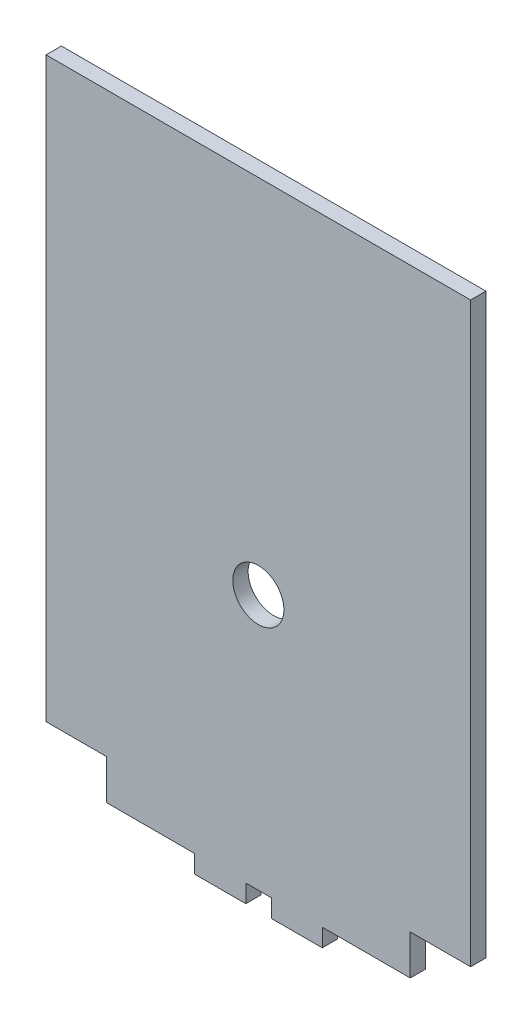
ISO-10303-21;
HEADER;
FILE_DESCRIPTION(('STEP AP214'),'2;1');
FILE_NAME('part.step','',(''),(''),'','','');
FILE_SCHEMA(('AUTOMOTIVE_DESIGN { 1 0 10303 214 1 1 1 1 }'));
ENDSEC;
DATA;
#1=APPLICATION_CONTEXT('core data for automotive mechanical design processes');
#2=APPLICATION_PROTOCOL_DEFINITION('international standard','automotive_design',2000,#1);
#3=PRODUCT_CONTEXT('',#1,'mechanical');
#4=PRODUCT('Part','Part','',(#3));
#5=PRODUCT_RELATED_PRODUCT_CATEGORY('part','',(#4));
#6=PRODUCT_DEFINITION_FORMATION('','',#4);
#7=PRODUCT_DEFINITION_CONTEXT('part definition',#1,'design');
#8=PRODUCT_DEFINITION('design','',#6,#7);
#9=PRODUCT_DEFINITION_SHAPE('','',#8);
#10=(LENGTH_UNIT() NAMED_UNIT(*) SI_UNIT(.MILLI.,.METRE.));
#11=(NAMED_UNIT(*) PLANE_ANGLE_UNIT() SI_UNIT($,.RADIAN.));
#12=(NAMED_UNIT(*) SI_UNIT($,.STERADIAN.) SOLID_ANGLE_UNIT());
#13=UNCERTAINTY_MEASURE_WITH_UNIT(LENGTH_MEASURE(1.E-05),#10,'distance_accuracy_value','');
#14=(GEOMETRIC_REPRESENTATION_CONTEXT(3) GLOBAL_UNCERTAINTY_ASSIGNED_CONTEXT((#13)) GLOBAL_UNIT_ASSIGNED_CONTEXT((#10,
#11,#12)) REPRESENTATION_CONTEXT('',''));
#15=CARTESIAN_POINT('',(0.,0.,0.));
#16=DIRECTION('',(0.,0.,1.));
#17=DIRECTION('',(1.,0.,0.));
#18=AXIS2_PLACEMENT_3D('',#15,#16,#17);
#19=CARTESIAN_POINT('',(0.,0.,3.));
#20=DIRECTION('',(0.,0.,-1.));
#21=DIRECTION('',(-1.,0.,0.));
#22=AXIS2_PLACEMENT_3D('',#19,#20,#21);
#23=PLANE('',#22);
#24=DIRECTION('',(-0.999999999999963,2.71602498102676E-07,0.));
#25=VECTOR('',#24,1.);
#26=CARTESIAN_POINT('',(38.6232862395123,-12.8450645036732,3.));
#27=LINE('',#26,#25);
#28=CARTESIAN_POINT('',(93.1522290063544,-12.8450793139341,3.));
#29=VERTEX_POINT('',#28);
#30=CARTESIAN_POINT('',(10.1522276542944,-12.8450567709591,3.));
#31=VERTEX_POINT('',#30);
#32=EDGE_CURVE('E50',#29,#31,#27,.T.);
#33=ORIENTED_EDGE('',*,*,#32,.T.);
#34=DIRECTION('',(-1.79961441962756E-07,-0.999999999999984,0.));
#35=VECTOR('',#34,1.);
#36=CARTESIAN_POINT('',(10.1522226708003,-40.5370668536615,3.));
#37=LINE('',#36,#35);
#38=CARTESIAN_POINT('',(10.1522226708003,-40.5370668536615,3.));
#39=VERTEX_POINT('',#38);
#40=EDGE_CURVE('E308',#31,#39,#37,.T.);
#41=ORIENTED_EDGE('',*,*,#40,.T.);
#42=DIRECTION('',(-2.15869174278283E-07,-0.999999999999977,0.));
#43=VECTOR('',#42,1.);
#44=CARTESIAN_POINT('',(10.1522226708003,-40.5370668536615,3.));
#45=LINE('',#44,#43);
#46=CARTESIAN_POINT('',(10.1522042770186,-125.745072081253,3.));
#47=VERTEX_POINT('',#46);
#48=EDGE_CURVE('E309',#39,#47,#45,.T.);
#49=ORIENTED_EDGE('',*,*,#48,.T.);
#50=DIRECTION('',(0.999999999999999,-3.74925588958727E-08,0.));
#51=VECTOR('',#50,1.);
#52=CARTESIAN_POINT('',(10.1522042770186,-125.745072081253,3.));
#53=LINE('',#52,#51);
#54=CARTESIAN_POINT('',(21.9522041501799,-125.745072523666,3.));
#55=VERTEX_POINT('',#54);
#56=EDGE_CURVE('E256',#47,#55,#53,.T.);
#57=ORIENTED_EDGE('',*,*,#56,.T.);
#58=DIRECTION('',(-2.87206058910175E-07,-0.999999999999959,0.));
#59=VECTOR('',#58,1.);
#60=CARTESIAN_POINT('',(21.9522041501799,-125.745072523666,3.));
#61=LINE('',#60,#59);
#62=CARTESIAN_POINT('',(21.9522019127166,-133.535518227548,3.));
#63=VERTEX_POINT('',#62);
#64=EDGE_CURVE('E276',#55,#63,#61,.T.);
#65=ORIENTED_EDGE('',*,*,#64,.T.);
#66=DIRECTION('',(0.99999988146846,-0.000486891226533724,0.));
#67=VECTOR('',#66,1.);
#68=CARTESIAN_POINT('',(21.9522019127166,-133.535518227548,3.));
#69=LINE('',#68,#67);
#70=CARTESIAN_POINT('',(39.1522154593375,-133.543892764233,3.));
#71=VERTEX_POINT('',#70);
#72=EDGE_CURVE('E273',#63,#71,#69,.T.);
#73=ORIENTED_EDGE('',*,*,#72,.T.);
#74=DIRECTION('',(0.,-1.,0.));
#75=VECTOR('',#74,1.);
#76=CARTESIAN_POINT('',(39.1522154593375,-133.543892764233,3.));
#77=LINE('',#76,#75);
#78=CARTESIAN_POINT('',(39.1522154593377,-137.037426112164,3.));
#79=VERTEX_POINT('',#78);
#80=EDGE_CURVE('E275',#71,#79,#77,.T.);
#81=ORIENTED_EDGE('',*,*,#80,.T.);
#82=DIRECTION('',(1.,0.,0.));
#83=VECTOR('',#82,1.);
#84=CARTESIAN_POINT('',(39.1522154593377,-137.037426112164,3.));
#85=LINE('',#84,#83);
#86=CARTESIAN_POINT('',(49.2022154593377,-137.037426112164,3.));
#87=VERTEX_POINT('',#86);
#88=EDGE_CURVE('E278',#79,#87,#85,.T.);
#89=ORIENTED_EDGE('',*,*,#88,.T.);
#90=DIRECTION('',(0.,1.,0.));
#91=VECTOR('',#90,1.);
#92=CARTESIAN_POINT('',(49.2022154593377,-137.037426112164,3.));
#93=LINE('',#92,#91);
#94=CARTESIAN_POINT('',(49.2022154593377,-133.537426112164,3.));
#95=VERTEX_POINT('',#94);
#96=EDGE_CURVE('E284',#87,#95,#93,.T.);
#97=ORIENTED_EDGE('',*,*,#96,.T.);
#98=DIRECTION('',(1.,0.,0.));
#99=VECTOR('',#98,1.);
#100=CARTESIAN_POINT('',(49.2022154593377,-133.537426112164,3.));
#101=LINE('',#100,#99);
#102=CARTESIAN_POINT('',(54.2022154593377,-133.537426112164,3.));
#103=VERTEX_POINT('',#102);
#104=EDGE_CURVE('E286',#95,#103,#101,.T.);
#105=ORIENTED_EDGE('',*,*,#104,.T.);
#106=DIRECTION('',(0.,-1.,0.));
#107=VECTOR('',#106,1.);
#108=CARTESIAN_POINT('',(54.2022154593377,-133.537426112164,3.));
#109=LINE('',#108,#107);
#110=CARTESIAN_POINT('',(54.2022154593377,-137.037426112164,3.));
#111=VERTEX_POINT('',#110);
#112=EDGE_CURVE('E288',#103,#111,#109,.T.);
#113=ORIENTED_EDGE('',*,*,#112,.T.);
#114=DIRECTION('',(1.,0.,0.));
#115=VECTOR('',#114,1.);
#116=CARTESIAN_POINT('',(54.2022154593377,-137.037426112164,3.));
#117=LINE('',#116,#115);
#118=CARTESIAN_POINT('',(64.1522154593377,-137.037426112164,3.));
#119=VERTEX_POINT('',#118);
#120=EDGE_CURVE('E290',#111,#119,#117,.T.);
#121=ORIENTED_EDGE('',*,*,#120,.T.);
#122=DIRECTION('',(0.,1.,0.));
#123=VECTOR('',#122,1.);
#124=CARTESIAN_POINT('',(64.1522154593377,-137.037426112164,3.));
#125=LINE('',#124,#123);
#126=CARTESIAN_POINT('',(64.1522154593377,-133.537426112164,3.));
#127=VERTEX_POINT('',#126);
#128=EDGE_CURVE('E292',#119,#127,#125,.T.);
#129=ORIENTED_EDGE('',*,*,#128,.T.);
#130=DIRECTION('',(0.999999965177503,-0.000263903376842765,0.));
#131=VECTOR('',#130,1.);
#132=CARTESIAN_POINT('',(64.1522154593377,-133.537426112164,3.));
#133=LINE('',#132,#131);
#134=CARTESIAN_POINT('',(81.3522290063543,-133.541965253979,3.));
#135=VERTEX_POINT('',#134);
#136=EDGE_CURVE('E165',#127,#135,#133,.T.);
#137=ORIENTED_EDGE('',*,*,#136,.T.);
#138=DIRECTION('',(0.,1.,0.));
#139=VECTOR('',#138,1.);
#140=CARTESIAN_POINT('',(81.3522290063543,-133.541965253979,3.));
#141=LINE('',#140,#139);
#142=CARTESIAN_POINT('',(81.3522290063544,-125.745072523665,3.));
#143=VERTEX_POINT('',#142);
#144=EDGE_CURVE('E159',#135,#143,#141,.T.);
#145=ORIENTED_EDGE('',*,*,#144,.T.);
#146=DIRECTION('',(1.,0.,0.));
#147=VECTOR('',#146,1.);
#148=CARTESIAN_POINT('',(81.3522290063544,-125.745072523665,3.));
#149=LINE('',#148,#147);
#150=CARTESIAN_POINT('',(93.1522290063544,-125.745072523665,3.));
#151=VERTEX_POINT('',#150);
#152=EDGE_CURVE('E163',#143,#151,#149,.T.);
#153=ORIENTED_EDGE('',*,*,#152,.T.);
#154=DIRECTION('',(0.,1.,0.));
#155=VECTOR('',#154,1.);
#156=CARTESIAN_POINT('',(93.1522290063544,-125.745072523665,3.));
#157=LINE('',#156,#155);
#158=EDGE_CURVE('E179',#151,#29,#157,.T.);
#159=ORIENTED_EDGE('',*,*,#158,.T.);
#160=EDGE_LOOP('',(#33,#41,#49,#57,#65,#73,#81,#89,#97,#105,#113,#121,#129,#137,#145,#153,#159));
#161=FACE_BOUND('',#160,.T.);
#162=CARTESIAN_POINT('',(51.6522290063544,-83.5450793139341,3.));
#163=DIRECTION('',(0.,0.,1.));
#164=DIRECTION('',(1.,0.,0.));
#165=AXIS2_PLACEMENT_3D('',#162,#163,#164);
#166=CIRCLE('',#165,5.);
#167=CARTESIAN_POINT('',(56.6522290063544,-83.5450793139341,3.));
#168=VERTEX_POINT('',#167);
#169=EDGE_CURVE('E188',#168,#168,#166,.T.);
#170=ORIENTED_EDGE('',*,*,#169,.F.);
#171=EDGE_LOOP('',(#170));
#172=FACE_BOUND('',#171,.T.);
#173=ADVANCED_FACE('F33',(#161,#172),#23,.F.);
#174=CARTESIAN_POINT('',(0.,0.,0.));
#175=DIRECTION('',(0.,0.,-1.));
#176=DIRECTION('',(-1.,0.,0.));
#177=AXIS2_PLACEMENT_3D('',#174,#175,#176);
#178=PLANE('',#177);
#179=DIRECTION('',(-1.79961441962756E-07,-0.999999999999984,0.));
#180=VECTOR('',#179,1.);
#181=CARTESIAN_POINT('',(10.1522226708003,-40.5370668536615,0.));
#182=LINE('',#181,#180);
#183=CARTESIAN_POINT('',(10.1522276542944,-12.8450567709591,0.));
#184=VERTEX_POINT('',#183);
#185=CARTESIAN_POINT('',(10.1522226708003,-40.5370668536615,0.));
#186=VERTEX_POINT('',#185);
#187=EDGE_CURVE('E185',#184,#186,#182,.T.);
#188=ORIENTED_EDGE('',*,*,#187,.F.);
#189=DIRECTION('',(-0.999999999999963,2.71588916447412E-07,0.));
#190=VECTOR('',#189,1.);
#191=CARTESIAN_POINT('',(51.4522289791975,-12.8450679880461,0.));
#192=LINE('',#191,#190);
#193=CARTESIAN_POINT('',(93.1522290063544,-12.8450793139341,0.));
#194=VERTEX_POINT('',#193);
#195=EDGE_CURVE('E114',#194,#184,#192,.T.);
#196=ORIENTED_EDGE('',*,*,#195,.F.);
#197=DIRECTION('',(0.,1.,0.));
#198=VECTOR('',#197,1.);
#199=CARTESIAN_POINT('',(93.1522290063544,-125.745072523665,0.));
#200=LINE('',#199,#198);
#201=CARTESIAN_POINT('',(93.1522290063544,-125.745072523665,0.));
#202=VERTEX_POINT('',#201);
#203=EDGE_CURVE('E214',#202,#194,#200,.T.);
#204=ORIENTED_EDGE('',*,*,#203,.F.);
#205=DIRECTION('',(1.,0.,0.));
#206=VECTOR('',#205,1.);
#207=CARTESIAN_POINT('',(81.3522290063544,-125.745072523665,0.));
#208=LINE('',#207,#206);
#209=CARTESIAN_POINT('',(81.3522290063544,-125.745072523665,0.));
#210=VERTEX_POINT('',#209);
#211=EDGE_CURVE('E107',#210,#202,#208,.T.);
#212=ORIENTED_EDGE('',*,*,#211,.F.);
#213=DIRECTION('',(0.,1.,0.));
#214=VECTOR('',#213,1.);
#215=CARTESIAN_POINT('',(81.3522290063543,-133.541965253979,0.));
#216=LINE('',#215,#214);
#217=CARTESIAN_POINT('',(81.3522290063543,-133.541965253979,0.));
#218=VERTEX_POINT('',#217);
#219=EDGE_CURVE('E173',#218,#210,#216,.T.);
#220=ORIENTED_EDGE('',*,*,#219,.F.);
#221=DIRECTION('',(0.999999965177503,-0.000263903376842765,0.));
#222=VECTOR('',#221,1.);
#223=CARTESIAN_POINT('',(64.1522154593377,-133.537426112164,0.));
#224=LINE('',#223,#222);
#225=CARTESIAN_POINT('',(64.1522154593377,-133.537426112164,0.));
#226=VERTEX_POINT('',#225);
#227=EDGE_CURVE('E210',#226,#218,#224,.T.);
#228=ORIENTED_EDGE('',*,*,#227,.F.);
#229=DIRECTION('',(0.,1.,0.));
#230=VECTOR('',#229,1.);
#231=CARTESIAN_POINT('',(64.1522154593377,-137.037426112164,0.));
#232=LINE('',#231,#230);
#233=CARTESIAN_POINT('',(64.1522154593377,-137.037426112164,0.));
#234=VERTEX_POINT('',#233);
#235=EDGE_CURVE('E208',#234,#226,#232,.T.);
#236=ORIENTED_EDGE('',*,*,#235,.F.);
#237=DIRECTION('',(1.,0.,0.));
#238=VECTOR('',#237,1.);
#239=CARTESIAN_POINT('',(54.2022154593377,-137.037426112164,0.));
#240=LINE('',#239,#238);
#241=CARTESIAN_POINT('',(54.2022154593377,-137.037426112164,0.));
#242=VERTEX_POINT('',#241);
#243=EDGE_CURVE('E206',#242,#234,#240,.T.);
#244=ORIENTED_EDGE('',*,*,#243,.F.);
#245=DIRECTION('',(0.,-1.,0.));
#246=VECTOR('',#245,1.);
#247=CARTESIAN_POINT('',(54.2022154593377,-133.537426112164,0.));
#248=LINE('',#247,#246);
#249=CARTESIAN_POINT('',(54.2022154593377,-133.537426112164,0.));
#250=VERTEX_POINT('',#249);
#251=EDGE_CURVE('E204',#250,#242,#248,.T.);
#252=ORIENTED_EDGE('',*,*,#251,.F.);
#253=DIRECTION('',(1.,0.,0.));
#254=VECTOR('',#253,1.);
#255=CARTESIAN_POINT('',(49.2022154593377,-133.537426112164,0.));
#256=LINE('',#255,#254);
#257=CARTESIAN_POINT('',(49.2022154593377,-133.537426112164,0.));
#258=VERTEX_POINT('',#257);
#259=EDGE_CURVE('E202',#258,#250,#256,.T.);
#260=ORIENTED_EDGE('',*,*,#259,.F.);
#261=DIRECTION('',(0.,1.,0.));
#262=VECTOR('',#261,1.);
#263=CARTESIAN_POINT('',(49.2022154593377,-137.037426112164,0.));
#264=LINE('',#263,#262);
#265=CARTESIAN_POINT('',(49.2022154593377,-137.037426112164,0.));
#266=VERTEX_POINT('',#265);
#267=EDGE_CURVE('E200',#266,#258,#264,.T.);
#268=ORIENTED_EDGE('',*,*,#267,.F.);
#269=DIRECTION('',(1.,0.,0.));
#270=VECTOR('',#269,1.);
#271=CARTESIAN_POINT('',(39.1522154593377,-137.037426112164,0.));
#272=LINE('',#271,#270);
#273=CARTESIAN_POINT('',(39.1522154593377,-137.037426112164,0.));
#274=VERTEX_POINT('',#273);
#275=EDGE_CURVE('E198',#274,#266,#272,.T.);
#276=ORIENTED_EDGE('',*,*,#275,.F.);
#277=DIRECTION('',(0.,-1.,0.));
#278=VECTOR('',#277,1.);
#279=CARTESIAN_POINT('',(39.1522154593375,-133.543892764233,0.));
#280=LINE('',#279,#278);
#281=CARTESIAN_POINT('',(39.1522154593375,-133.543892764233,0.));
#282=VERTEX_POINT('',#281);
#283=EDGE_CURVE('E196',#282,#274,#280,.T.);
#284=ORIENTED_EDGE('',*,*,#283,.F.);
#285=DIRECTION('',(0.99999988146846,-0.000486891226533724,0.));
#286=VECTOR('',#285,1.);
#287=CARTESIAN_POINT('',(21.9522019127166,-133.535518227548,0.));
#288=LINE('',#287,#286);
#289=CARTESIAN_POINT('',(21.9522019127166,-133.535518227548,0.));
#290=VERTEX_POINT('',#289);
#291=EDGE_CURVE('E194',#290,#282,#288,.T.);
#292=ORIENTED_EDGE('',*,*,#291,.F.);
#293=DIRECTION('',(-2.87206058910175E-07,-0.999999999999959,0.));
#294=VECTOR('',#293,1.);
#295=CARTESIAN_POINT('',(21.9522041501799,-125.745072523666,0.));
#296=LINE('',#295,#294);
#297=CARTESIAN_POINT('',(21.9522041501799,-125.745072523666,0.));
#298=VERTEX_POINT('',#297);
#299=EDGE_CURVE('E192',#298,#290,#296,.T.);
#300=ORIENTED_EDGE('',*,*,#299,.F.);
#301=DIRECTION('',(0.999999999999999,-3.74925588958727E-08,0.));
#302=VECTOR('',#301,1.);
#303=CARTESIAN_POINT('',(10.1522042770186,-125.745072081253,0.));
#304=LINE('',#303,#302);
#305=CARTESIAN_POINT('',(10.1522042770186,-125.745072081253,0.));
#306=VERTEX_POINT('',#305);
#307=EDGE_CURVE('E190',#306,#298,#304,.T.);
#308=ORIENTED_EDGE('',*,*,#307,.F.);
#309=DIRECTION('',(-2.15869174278283E-07,-0.999999999999977,0.));
#310=VECTOR('',#309,1.);
#311=CARTESIAN_POINT('',(10.1522226708003,-40.5370668536615,0.));
#312=LINE('',#311,#310);
#313=EDGE_CURVE('E187',#186,#306,#312,.T.);
#314=ORIENTED_EDGE('',*,*,#313,.F.);
#315=EDGE_LOOP('',(#188,#196,#204,#212,#220,#228,#236,#244,#252,#260,#268,#276,#284,#292,#300,
#308,#314));
#316=FACE_BOUND('',#315,.T.);
#317=CARTESIAN_POINT('',(51.6522290063544,-83.5450793139341,0.));
#318=DIRECTION('',(0.,0.,1.));
#319=DIRECTION('',(1.,0.,0.));
#320=AXIS2_PLACEMENT_3D('',#317,#318,#319);
#321=CIRCLE('',#320,5.);
#322=CARTESIAN_POINT('',(56.6522290063544,-83.5450793139341,0.));
#323=VERTEX_POINT('',#322);
#324=EDGE_CURVE('E314',#323,#323,#321,.T.);
#325=ORIENTED_EDGE('',*,*,#324,.T.);
#326=EDGE_LOOP('',(#325));
#327=FACE_BOUND('',#326,.T.);
#328=ADVANCED_FACE('F261',(#316,#327),#178,.T.);
#329=CARTESIAN_POINT('',(10.1522226708003,-40.5370668536615,3.));
#330=DIRECTION('',(0.999999999999977,-2.15869174278283E-07,0.));
#331=DIRECTION('',(2.15869174278283E-07,0.999999999999977,0.));
#332=AXIS2_PLACEMENT_3D('',#329,#330,#331);
#333=PLANE('',#332);
#334=ORIENTED_EDGE('',*,*,#313,.T.);
#335=DIRECTION('',(0.,0.,-1.));
#336=VECTOR('',#335,1.);
#337=CARTESIAN_POINT('',(10.1522042770186,-125.745072081253,3.));
#338=LINE('',#337,#336);
#339=EDGE_CURVE('E42',#47,#306,#338,.T.);
#340=ORIENTED_EDGE('',*,*,#339,.F.);
#341=ORIENTED_EDGE('',*,*,#48,.F.);
#342=ORIENTED_EDGE('',*,*,#40,.F.);
#343=DIRECTION('',(0.,0.,-1.));
#344=VECTOR('',#343,1.);
#345=CARTESIAN_POINT('',(10.1522276542944,-12.8450567709591,3.));
#346=LINE('',#345,#344);
#347=EDGE_CURVE('E11',#31,#184,#346,.T.);
#348=ORIENTED_EDGE('',*,*,#347,.T.);
#349=ORIENTED_EDGE('',*,*,#187,.T.);
#350=EDGE_LOOP('',(#334,#340,#341,#342,#348,#349));
#351=FACE_BOUND('',#350,.T.);
#352=ADVANCED_FACE('F35',(#351),#333,.F.);
#353=CARTESIAN_POINT('',(10.1522042770186,-125.745072081253,3.));
#354=DIRECTION('',(3.74925588958727E-08,0.999999999999999,0.));
#355=DIRECTION('',(-0.999999999999999,3.74925588958727E-08,0.));
#356=AXIS2_PLACEMENT_3D('',#353,#354,#355);
#357=PLANE('',#356);
#358=ORIENTED_EDGE('',*,*,#307,.T.);
#359=DIRECTION('',(0.,0.,-1.));
#360=VECTOR('',#359,1.);
#361=CARTESIAN_POINT('',(21.9522041501799,-125.745072523666,3.));
#362=LINE('',#361,#360);
#363=EDGE_CURVE('E247',#55,#298,#362,.T.);
#364=ORIENTED_EDGE('',*,*,#363,.F.);
#365=ORIENTED_EDGE('',*,*,#56,.F.);
#366=ORIENTED_EDGE('',*,*,#339,.T.);
#367=EDGE_LOOP('',(#358,#364,#365,#366));
#368=FACE_BOUND('',#367,.T.);
#369=ADVANCED_FACE('F254',(#368),#357,.F.);
#370=CARTESIAN_POINT('',(21.9522041501799,-125.745072523666,3.));
#371=DIRECTION('',(0.999999999999959,-2.87206058910175E-07,0.));
#372=DIRECTION('',(2.87206058910175E-07,0.999999999999959,0.));
#373=AXIS2_PLACEMENT_3D('',#370,#371,#372);
#374=PLANE('',#373);
#375=ORIENTED_EDGE('',*,*,#299,.T.);
#376=DIRECTION('',(0.,0.,-1.));
#377=VECTOR('',#376,1.);
#378=CARTESIAN_POINT('',(21.9522019127166,-133.535518227548,3.));
#379=LINE('',#378,#377);
#380=EDGE_CURVE('E244',#63,#290,#379,.T.);
#381=ORIENTED_EDGE('',*,*,#380,.F.);
#382=ORIENTED_EDGE('',*,*,#64,.F.);
#383=ORIENTED_EDGE('',*,*,#363,.T.);
#384=EDGE_LOOP('',(#375,#381,#382,#383));
#385=FACE_BOUND('',#384,.T.);
#386=ADVANCED_FACE('F267',(#385),#374,.F.);
#387=CARTESIAN_POINT('',(21.9522019127166,-133.535518227548,3.));
#388=DIRECTION('',(0.000486891226533724,0.99999988146846,0.));
#389=DIRECTION('',(-0.99999988146846,0.000486891226533724,0.));
#390=AXIS2_PLACEMENT_3D('',#387,#388,#389);
#391=PLANE('',#390);
#392=ORIENTED_EDGE('',*,*,#291,.T.);
#393=DIRECTION('',(0.,0.,-1.));
#394=VECTOR('',#393,1.);
#395=CARTESIAN_POINT('',(39.1522154593375,-133.543892764233,3.));
#396=LINE('',#395,#394);
#397=EDGE_CURVE('E241',#71,#282,#396,.T.);
#398=ORIENTED_EDGE('',*,*,#397,.F.);
#399=ORIENTED_EDGE('',*,*,#72,.F.);
#400=ORIENTED_EDGE('',*,*,#380,.T.);
#401=EDGE_LOOP('',(#392,#398,#399,#400));
#402=FACE_BOUND('',#401,.T.);
#403=ADVANCED_FACE('F271',(#402),#391,.F.);
#404=CARTESIAN_POINT('',(39.1522154593375,-133.543892764233,3.));
#405=DIRECTION('',(1.,0.,0.));
#406=DIRECTION('',(0.,1.,0.));
#407=AXIS2_PLACEMENT_3D('',#404,#405,#406);
#408=PLANE('',#407);
#409=ORIENTED_EDGE('',*,*,#283,.T.);
#410=DIRECTION('',(0.,0.,-1.));
#411=VECTOR('',#410,1.);
#412=CARTESIAN_POINT('',(39.1522154593377,-137.037426112164,3.));
#413=LINE('',#412,#411);
#414=EDGE_CURVE('E238',#79,#274,#413,.T.);
#415=ORIENTED_EDGE('',*,*,#414,.F.);
#416=ORIENTED_EDGE('',*,*,#80,.F.);
#417=ORIENTED_EDGE('',*,*,#397,.T.);
#418=EDGE_LOOP('',(#409,#415,#416,#417));
#419=FACE_BOUND('',#418,.T.);
#420=ADVANCED_FACE('F361',(#419),#408,.F.);
#421=CARTESIAN_POINT('',(39.1522154593377,-137.037426112164,3.));
#422=DIRECTION('',(0.,1.,0.));
#423=DIRECTION('',(0.,0.,1.));
#424=AXIS2_PLACEMENT_3D('',#421,#422,#423);
#425=PLANE('',#424);
#426=ORIENTED_EDGE('',*,*,#275,.T.);
#427=DIRECTION('',(0.,0.,-1.));
#428=VECTOR('',#427,1.);
#429=CARTESIAN_POINT('',(49.2022154593377,-137.037426112164,3.));
#430=LINE('',#429,#428);
#431=EDGE_CURVE('E235',#87,#266,#430,.T.);
#432=ORIENTED_EDGE('',*,*,#431,.F.);
#433=ORIENTED_EDGE('',*,*,#88,.F.);
#434=ORIENTED_EDGE('',*,*,#414,.T.);
#435=EDGE_LOOP('',(#426,#432,#433,#434));
#436=FACE_BOUND('',#435,.T.);
#437=ADVANCED_FACE('F357',(#436),#425,.F.);
#438=CARTESIAN_POINT('',(49.2022154593377,-137.037426112164,3.));
#439=DIRECTION('',(-1.,0.,0.));
#440=DIRECTION('',(0.,0.,1.));
#441=AXIS2_PLACEMENT_3D('',#438,#439,#440);
#442=PLANE('',#441);
#443=ORIENTED_EDGE('',*,*,#267,.T.);
#444=DIRECTION('',(0.,0.,-1.));
#445=VECTOR('',#444,1.);
#446=CARTESIAN_POINT('',(49.2022154593377,-133.537426112164,3.));
#447=LINE('',#446,#445);
#448=EDGE_CURVE('E232',#95,#258,#447,.T.);
#449=ORIENTED_EDGE('',*,*,#448,.F.);
#450=ORIENTED_EDGE('',*,*,#96,.F.);
#451=ORIENTED_EDGE('',*,*,#431,.T.);
#452=EDGE_LOOP('',(#443,#449,#450,#451));
#453=FACE_BOUND('',#452,.T.);
#454=ADVANCED_FACE('F353',(#453),#442,.F.);
#455=CARTESIAN_POINT('',(49.2022154593377,-133.537426112164,3.));
#456=DIRECTION('',(0.,1.,0.));
#457=DIRECTION('',(0.,0.,1.));
#458=AXIS2_PLACEMENT_3D('',#455,#456,#457);
#459=PLANE('',#458);
#460=ORIENTED_EDGE('',*,*,#259,.T.);
#461=DIRECTION('',(0.,0.,-1.));
#462=VECTOR('',#461,1.);
#463=CARTESIAN_POINT('',(54.2022154593377,-133.537426112164,3.));
#464=LINE('',#463,#462);
#465=EDGE_CURVE('E229',#103,#250,#464,.T.);
#466=ORIENTED_EDGE('',*,*,#465,.F.);
#467=ORIENTED_EDGE('',*,*,#104,.F.);
#468=ORIENTED_EDGE('',*,*,#448,.T.);
#469=EDGE_LOOP('',(#460,#466,#467,#468));
#470=FACE_BOUND('',#469,.T.);
#471=ADVANCED_FACE('F349',(#470),#459,.F.);
#472=CARTESIAN_POINT('',(54.2022154593377,-133.537426112164,3.));
#473=DIRECTION('',(1.,0.,0.));
#474=DIRECTION('',(0.,0.,-1.));
#475=AXIS2_PLACEMENT_3D('',#472,#473,#474);
#476=PLANE('',#475);
#477=ORIENTED_EDGE('',*,*,#251,.T.);
#478=DIRECTION('',(0.,0.,-1.));
#479=VECTOR('',#478,1.);
#480=CARTESIAN_POINT('',(54.2022154593377,-137.037426112164,3.));
#481=LINE('',#480,#479);
#482=EDGE_CURVE('E226',#111,#242,#481,.T.);
#483=ORIENTED_EDGE('',*,*,#482,.F.);
#484=ORIENTED_EDGE('',*,*,#112,.F.);
#485=ORIENTED_EDGE('',*,*,#465,.T.);
#486=EDGE_LOOP('',(#477,#483,#484,#485));
#487=FACE_BOUND('',#486,.T.);
#488=ADVANCED_FACE('F345',(#487),#476,.F.);
#489=CARTESIAN_POINT('',(54.2022154593377,-137.037426112164,3.));
#490=DIRECTION('',(0.,1.,0.));
#491=DIRECTION('',(-1.,0.,0.));
#492=AXIS2_PLACEMENT_3D('',#489,#490,#491);
#493=PLANE('',#492);
#494=ORIENTED_EDGE('',*,*,#243,.T.);
#495=DIRECTION('',(0.,0.,-1.));
#496=VECTOR('',#495,1.);
#497=CARTESIAN_POINT('',(64.1522154593377,-137.037426112164,3.));
#498=LINE('',#497,#496);
#499=EDGE_CURVE('E223',#119,#234,#498,.T.);
#500=ORIENTED_EDGE('',*,*,#499,.F.);
#501=ORIENTED_EDGE('',*,*,#120,.F.);
#502=ORIENTED_EDGE('',*,*,#482,.T.);
#503=EDGE_LOOP('',(#494,#500,#501,#502));
#504=FACE_BOUND('',#503,.T.);
#505=ADVANCED_FACE('F342',(#504),#493,.F.);
#506=CARTESIAN_POINT('',(64.1522154593377,-137.037426112164,3.));
#507=DIRECTION('',(-1.,0.,0.));
#508=DIRECTION('',(0.,0.,1.));
#509=AXIS2_PLACEMENT_3D('',#506,#507,#508);
#510=PLANE('',#509);
#511=ORIENTED_EDGE('',*,*,#235,.T.);
#512=DIRECTION('',(0.,0.,-1.));
#513=VECTOR('',#512,1.);
#514=CARTESIAN_POINT('',(64.1522154593377,-133.537426112164,3.));
#515=LINE('',#514,#513);
#516=EDGE_CURVE('E220',#127,#226,#515,.T.);
#517=ORIENTED_EDGE('',*,*,#516,.F.);
#518=ORIENTED_EDGE('',*,*,#128,.F.);
#519=ORIENTED_EDGE('',*,*,#499,.T.);
#520=EDGE_LOOP('',(#511,#517,#518,#519));
#521=FACE_BOUND('',#520,.T.);
#522=ADVANCED_FACE('F298',(#521),#510,.F.);
#523=CARTESIAN_POINT('',(64.1522154593377,-133.537426112164,3.));
#524=DIRECTION('',(0.000263903376842765,0.999999965177503,0.));
#525=DIRECTION('',(-0.999999965177503,0.000263903376842765,0.));
#526=AXIS2_PLACEMENT_3D('',#523,#524,#525);
#527=PLANE('',#526);
#528=ORIENTED_EDGE('',*,*,#227,.T.);
#529=DIRECTION('',(0.,0.,-1.));
#530=VECTOR('',#529,1.);
#531=CARTESIAN_POINT('',(81.3522290063543,-133.541965253979,3.));
#532=LINE('',#531,#530);
#533=EDGE_CURVE('E174',#135,#218,#532,.T.);
#534=ORIENTED_EDGE('',*,*,#533,.F.);
#535=ORIENTED_EDGE('',*,*,#136,.F.);
#536=ORIENTED_EDGE('',*,*,#516,.T.);
#537=EDGE_LOOP('',(#528,#534,#535,#536));
#538=FACE_BOUND('',#537,.T.);
#539=ADVANCED_FACE('F302',(#538),#527,.F.);
#540=CARTESIAN_POINT('',(81.3522290063543,-133.541965253979,3.));
#541=DIRECTION('',(-1.,0.,0.));
#542=DIRECTION('',(0.,-1.,0.));
#543=AXIS2_PLACEMENT_3D('',#540,#541,#542);
#544=PLANE('',#543);
#545=ORIENTED_EDGE('',*,*,#219,.T.);
#546=DIRECTION('',(0.,0.,-1.));
#547=VECTOR('',#546,1.);
#548=CARTESIAN_POINT('',(81.3522290063544,-125.745072523665,3.));
#549=LINE('',#548,#547);
#550=EDGE_CURVE('E170',#143,#210,#549,.T.);
#551=ORIENTED_EDGE('',*,*,#550,.F.);
#552=ORIENTED_EDGE('',*,*,#144,.F.);
#553=ORIENTED_EDGE('',*,*,#533,.T.);
#554=EDGE_LOOP('',(#545,#551,#552,#553));
#555=FACE_BOUND('',#554,.T.);
#556=ADVANCED_FACE('F171',(#555),#544,.F.);
#557=CARTESIAN_POINT('',(81.3522290063544,-125.745072523665,3.));
#558=DIRECTION('',(0.,1.,0.));
#559=DIRECTION('',(0.,0.,1.));
#560=AXIS2_PLACEMENT_3D('',#557,#558,#559);
#561=PLANE('',#560);
#562=ORIENTED_EDGE('',*,*,#211,.T.);
#563=DIRECTION('',(0.,0.,-1.));
#564=VECTOR('',#563,1.);
#565=CARTESIAN_POINT('',(93.1522290063544,-125.745072523665,3.));
#566=LINE('',#565,#564);
#567=EDGE_CURVE('E175',#151,#202,#566,.T.);
#568=ORIENTED_EDGE('',*,*,#567,.F.);
#569=ORIENTED_EDGE('',*,*,#152,.F.);
#570=ORIENTED_EDGE('',*,*,#550,.T.);
#571=EDGE_LOOP('',(#562,#568,#569,#570));
#572=FACE_BOUND('',#571,.T.);
#573=ADVANCED_FACE('F177',(#572),#561,.F.);
#574=CARTESIAN_POINT('',(93.1522290063544,-125.745072523665,3.));
#575=DIRECTION('',(-1.,0.,0.));
#576=DIRECTION('',(0.,0.,1.));
#577=AXIS2_PLACEMENT_3D('',#574,#575,#576);
#578=PLANE('',#577);
#579=ORIENTED_EDGE('',*,*,#203,.T.);
#580=DIRECTION('',(0.,0.,-1.));
#581=VECTOR('',#580,1.);
#582=CARTESIAN_POINT('',(93.1522290063544,-12.8450793139341,3.));
#583=LINE('',#582,#581);
#584=EDGE_CURVE('E181',#29,#194,#583,.T.);
#585=ORIENTED_EDGE('',*,*,#584,.F.);
#586=ORIENTED_EDGE('',*,*,#158,.F.);
#587=ORIENTED_EDGE('',*,*,#567,.T.);
#588=EDGE_LOOP('',(#579,#585,#586,#587));
#589=FACE_BOUND('',#588,.T.);
#590=ADVANCED_FACE('F305',(#589),#578,.F.);
#591=CARTESIAN_POINT('',(51.4522289791975,-12.8450679880461,3.));
#592=DIRECTION('',(-2.71588916447412E-07,-0.999999999999963,0.));
#593=DIRECTION('',(0.999999999999963,-2.71588916447412E-07,0.));
#594=AXIS2_PLACEMENT_3D('',#591,#592,#593);
#595=PLANE('',#594);
#596=ORIENTED_EDGE('',*,*,#195,.T.);
#597=ORIENTED_EDGE('',*,*,#347,.F.);
#598=ORIENTED_EDGE('',*,*,#32,.F.);
#599=ORIENTED_EDGE('',*,*,#584,.T.);
#600=EDGE_LOOP('',(#596,#597,#598,#599));
#601=FACE_BOUND('',#600,.T.);
#602=ADVANCED_FACE('F306',(#601),#595,.F.);
#603=CARTESIAN_POINT('',(51.6522290063544,-83.5450793139341,3.));
#604=DIRECTION('',(0.,0.,-1.));
#605=DIRECTION('',(-1.,0.,0.));
#606=AXIS2_PLACEMENT_3D('',#603,#604,#605);
#607=CYLINDRICAL_SURFACE('',#606,5.);
#608=ORIENTED_EDGE('',*,*,#169,.T.);
#609=EDGE_LOOP('',(#608));
#610=FACE_BOUND('',#609,.T.);
#611=ORIENTED_EDGE('',*,*,#324,.F.);
#612=EDGE_LOOP('',(#611));
#613=FACE_BOUND('',#612,.T.);
#614=ADVANCED_FACE('F320',(#610,#613),#607,.F.);
#615=CLOSED_SHELL('',(#173,#328,#352,#369,#386,#403,#420,#437,#454,#471,#488,#505,#522,#539,
#556,#573,#590,#602,#614));
#616=MANIFOLD_SOLID_BREP('B2',#615);
#617=ADVANCED_BREP_SHAPE_REPRESENTATION('',(#18,#616),#14);
#618=SHAPE_DEFINITION_REPRESENTATION(#9,#617);
ENDSEC;
END-ISO-10303-21;
